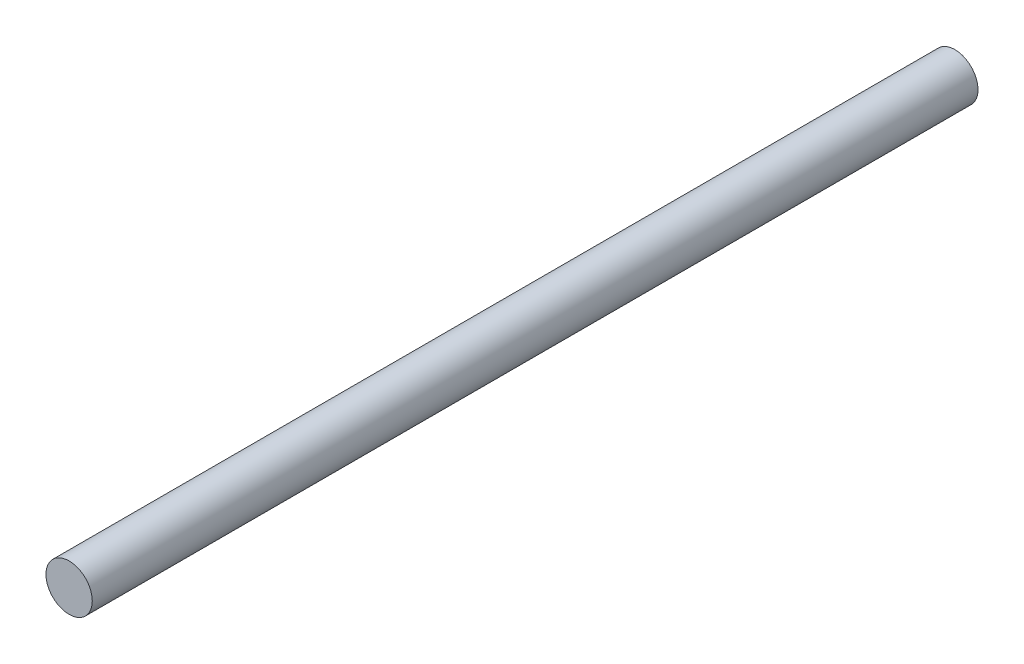
ISO-10303-21;
HEADER;
FILE_DESCRIPTION(('STEP AP214'),'2;1');
FILE_NAME('part.step','',(''),(''),'','','');
FILE_SCHEMA(('AUTOMOTIVE_DESIGN { 1 0 10303 214 1 1 1 1 }'));
ENDSEC;
DATA;
#1=APPLICATION_CONTEXT('core data for automotive mechanical design processes');
#2=APPLICATION_PROTOCOL_DEFINITION('international standard','automotive_design',2000,#1);
#3=PRODUCT_CONTEXT('',#1,'mechanical');
#4=PRODUCT('Part','Part','',(#3));
#5=PRODUCT_RELATED_PRODUCT_CATEGORY('part','',(#4));
#6=PRODUCT_DEFINITION_FORMATION('','',#4);
#7=PRODUCT_DEFINITION_CONTEXT('part definition',#1,'design');
#8=PRODUCT_DEFINITION('design','',#6,#7);
#9=PRODUCT_DEFINITION_SHAPE('','',#8);
#10=(LENGTH_UNIT() NAMED_UNIT(*) SI_UNIT(.MILLI.,.METRE.));
#11=(NAMED_UNIT(*) PLANE_ANGLE_UNIT() SI_UNIT($,.RADIAN.));
#12=(NAMED_UNIT(*) SI_UNIT($,.STERADIAN.) SOLID_ANGLE_UNIT());
#13=UNCERTAINTY_MEASURE_WITH_UNIT(LENGTH_MEASURE(1.E-05),#10,'distance_accuracy_value','');
#14=(GEOMETRIC_REPRESENTATION_CONTEXT(3) GLOBAL_UNCERTAINTY_ASSIGNED_CONTEXT((#13)) GLOBAL_UNIT_ASSIGNED_CONTEXT((#10,
#11,#12)) REPRESENTATION_CONTEXT('',''));
#15=CARTESIAN_POINT('',(0.,0.,0.));
#16=DIRECTION('',(0.,0.,1.));
#17=DIRECTION('',(1.,0.,0.));
#18=AXIS2_PLACEMENT_3D('',#15,#16,#17);
#19=CARTESIAN_POINT('',(0.,0.,153.));
#20=DIRECTION('',(0.,0.,-1.));
#21=DIRECTION('',(-1.,0.,0.));
#22=AXIS2_PLACEMENT_3D('',#19,#20,#21);
#23=CYLINDRICAL_SURFACE('',#22,4.);
#24=CARTESIAN_POINT('',(0.,0.,153.));
#25=DIRECTION('',(0.,0.,1.));
#26=DIRECTION('',(1.,0.,0.));
#27=AXIS2_PLACEMENT_3D('',#24,#25,#26);
#28=CIRCLE('',#27,4.);
#29=CARTESIAN_POINT('',(4.,0.,153.));
#30=VERTEX_POINT('',#29);
#31=EDGE_CURVE('E10',#30,#30,#28,.T.);
#32=ORIENTED_EDGE('',*,*,#31,.F.);
#33=EDGE_LOOP('',(#32));
#34=FACE_BOUND('',#33,.T.);
#35=CARTESIAN_POINT('',(0.,0.,0.));
#36=DIRECTION('',(0.,0.,1.));
#37=DIRECTION('',(1.,0.,0.));
#38=AXIS2_PLACEMENT_3D('',#35,#36,#37);
#39=CIRCLE('',#38,4.);
#40=CARTESIAN_POINT('',(4.,0.,0.));
#41=VERTEX_POINT('',#40);
#42=EDGE_CURVE('E34',#41,#41,#39,.T.);
#43=ORIENTED_EDGE('',*,*,#42,.T.);
#44=EDGE_LOOP('',(#43));
#45=FACE_BOUND('',#44,.T.);
#46=ADVANCED_FACE('F31',(#34,#45),#23,.T.);
#47=CARTESIAN_POINT('',(0.,0.,153.));
#48=DIRECTION('',(0.,0.,1.));
#49=DIRECTION('',(1.,0.,0.));
#50=AXIS2_PLACEMENT_3D('',#47,#48,#49);
#51=PLANE('',#50);
#52=ORIENTED_EDGE('',*,*,#31,.T.);
#53=EDGE_LOOP('',(#52));
#54=FACE_BOUND('',#53,.T.);
#55=ADVANCED_FACE('F46',(#54),#51,.T.);
#56=CARTESIAN_POINT('',(0.,0.,0.));
#57=DIRECTION('',(0.,0.,1.));
#58=DIRECTION('',(1.,0.,0.));
#59=AXIS2_PLACEMENT_3D('',#56,#57,#58);
#60=PLANE('',#59);
#61=ORIENTED_EDGE('',*,*,#42,.F.);
#62=EDGE_LOOP('',(#61));
#63=FACE_BOUND('',#62,.T.);
#64=ADVANCED_FACE('F44',(#63),#60,.F.);
#65=CLOSED_SHELL('',(#46,#55,#64));
#66=MANIFOLD_SOLID_BREP('B2',#65);
#67=ADVANCED_BREP_SHAPE_REPRESENTATION('',(#18,#66),#14);
#68=SHAPE_DEFINITION_REPRESENTATION(#9,#67);
ENDSEC;
END-ISO-10303-21;
